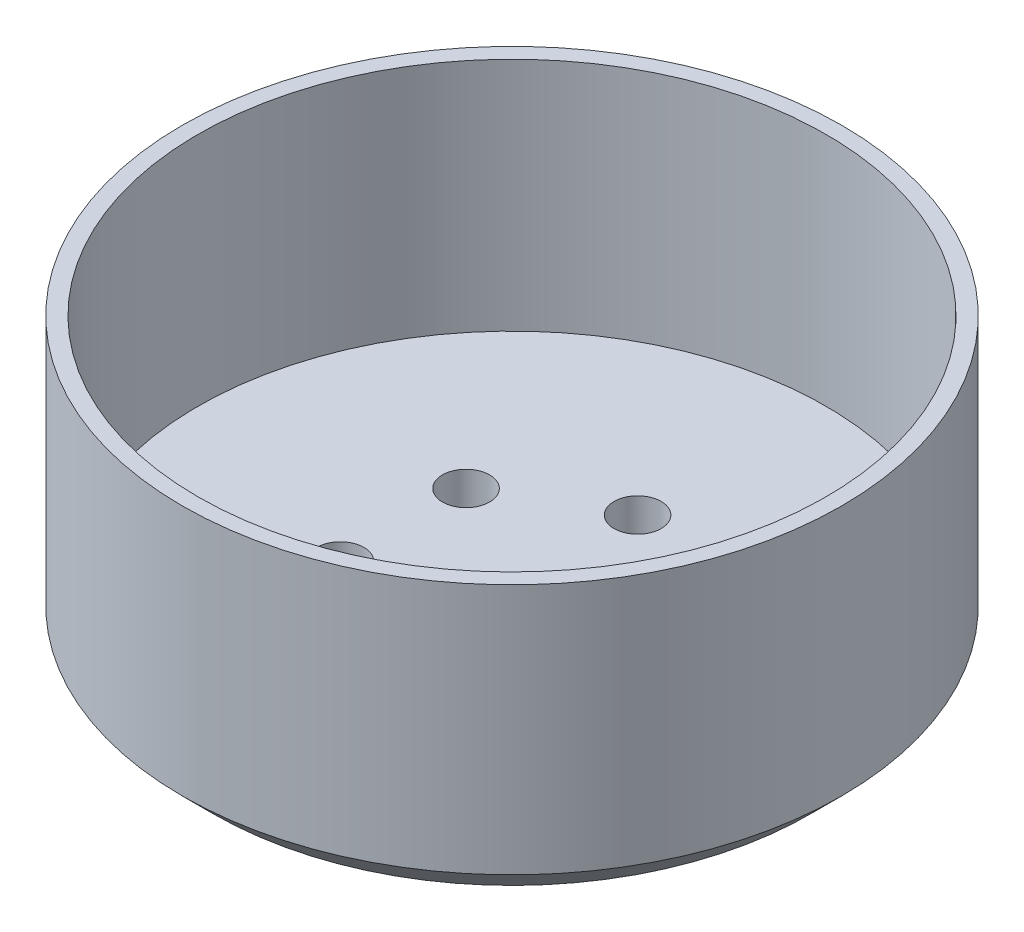
ISO-10303-21;
HEADER;
FILE_DESCRIPTION(('STEP AP214'),'2;1');
FILE_NAME('part.step','',(''),(''),'','','');
FILE_SCHEMA(('AUTOMOTIVE_DESIGN { 1 0 10303 214 1 1 1 1 }'));
ENDSEC;
DATA;
#1=APPLICATION_CONTEXT('core data for automotive mechanical design processes');
#2=APPLICATION_PROTOCOL_DEFINITION('international standard','automotive_design',2000,#1);
#3=PRODUCT_CONTEXT('',#1,'mechanical');
#4=PRODUCT('Part','Part','',(#3));
#5=PRODUCT_RELATED_PRODUCT_CATEGORY('part','',(#4));
#6=PRODUCT_DEFINITION_FORMATION('','',#4);
#7=PRODUCT_DEFINITION_CONTEXT('part definition',#1,'design');
#8=PRODUCT_DEFINITION('design','',#6,#7);
#9=PRODUCT_DEFINITION_SHAPE('','',#8);
#10=(LENGTH_UNIT() NAMED_UNIT(*) SI_UNIT(.MILLI.,.METRE.));
#11=(NAMED_UNIT(*) PLANE_ANGLE_UNIT() SI_UNIT($,.RADIAN.));
#12=(NAMED_UNIT(*) SI_UNIT($,.STERADIAN.) SOLID_ANGLE_UNIT());
#13=UNCERTAINTY_MEASURE_WITH_UNIT(LENGTH_MEASURE(1.E-05),#10,'distance_accuracy_value','');
#14=(GEOMETRIC_REPRESENTATION_CONTEXT(3) GLOBAL_UNCERTAINTY_ASSIGNED_CONTEXT((#13)) GLOBAL_UNIT_ASSIGNED_CONTEXT((#10,
#11,#12)) REPRESENTATION_CONTEXT('',''));
#15=CARTESIAN_POINT('',(0.,0.,0.));
#16=DIRECTION('',(0.,0.,1.));
#17=DIRECTION('',(1.,0.,0.));
#18=AXIS2_PLACEMENT_3D('',#15,#16,#17);
#19=CARTESIAN_POINT('',(0.,18.,0.));
#20=DIRECTION('',(0.,-1.,0.));
#21=DIRECTION('',(0.,0.,-1.));
#22=AXIS2_PLACEMENT_3D('',#19,#20,#21);
#23=CYLINDRICAL_SURFACE('',#22,21.);
#24=CARTESIAN_POINT('',(0.,18.,0.));
#25=DIRECTION('',(0.,1.,0.));
#26=DIRECTION('',(0.,0.,1.));
#27=AXIS2_PLACEMENT_3D('',#24,#25,#26);
#28=CIRCLE('',#27,21.);
#29=CARTESIAN_POINT('',(0.,18.,21.));
#30=VERTEX_POINT('',#29);
#31=EDGE_CURVE('E50',#30,#30,#28,.T.);
#32=ORIENTED_EDGE('',*,*,#31,.F.);
#33=EDGE_LOOP('',(#32));
#34=FACE_BOUND('',#33,.T.);
#35=CARTESIAN_POINT('',(0.,2.,0.));
#36=DIRECTION('',(0.,1.,0.));
#37=DIRECTION('',(0.,0.,1.));
#38=AXIS2_PLACEMENT_3D('',#35,#36,#37);
#39=CIRCLE('',#38,21.);
#40=CARTESIAN_POINT('',(0.,2.,21.));
#41=VERTEX_POINT('',#40);
#42=EDGE_CURVE('E59',#41,#41,#39,.T.);
#43=ORIENTED_EDGE('',*,*,#42,.T.);
#44=EDGE_LOOP('',(#43));
#45=FACE_BOUND('',#44,.T.);
#46=ADVANCED_FACE('F39',(#34,#45),#23,.T.);
#47=CARTESIAN_POINT('',(0.,3.,0.));
#48=DIRECTION('',(0.,1.,0.));
#49=DIRECTION('',(0.,0.,1.));
#50=AXIS2_PLACEMENT_3D('',#47,#48,#49);
#51=PLANE('',#50);
#52=CARTESIAN_POINT('',(0.,3.,8.));
#53=DIRECTION('',(0.,1.,0.));
#54=DIRECTION('',(0.,0.,1.));
#55=AXIS2_PLACEMENT_3D('',#52,#53,#54);
#56=CIRCLE('',#55,1.5);
#57=CARTESIAN_POINT('',(0.,3.,9.5));
#58=VERTEX_POINT('',#57);
#59=EDGE_CURVE('E65',#58,#58,#56,.T.);
#60=ORIENTED_EDGE('',*,*,#59,.F.);
#61=EDGE_LOOP('',(#60));
#62=FACE_BOUND('',#61,.T.);
#63=CARTESIAN_POINT('',(-6.92820323027534,3.,3.9999999999997));
#64=DIRECTION('',(0.,1.,0.));
#65=DIRECTION('',(0.,0.,1.));
#66=AXIS2_PLACEMENT_3D('',#63,#64,#65);
#67=CIRCLE('',#66,1.50000000000034);
#68=CARTESIAN_POINT('',(-6.92820323027534,3.,5.50000000000004));
#69=VERTEX_POINT('',#68);
#70=EDGE_CURVE('E68',#69,#69,#67,.T.);
#71=ORIENTED_EDGE('',*,*,#70,.F.);
#72=EDGE_LOOP('',(#71));
#73=FACE_BOUND('',#72,.T.);
#74=CARTESIAN_POINT('',(-6.928203230275,3.,-4.0000000000003));
#75=DIRECTION('',(0.,1.,0.));
#76=DIRECTION('',(0.,0.,1.));
#77=AXIS2_PLACEMENT_3D('',#74,#75,#76);
#78=CIRCLE('',#77,1.50000000000065);
#79=CARTESIAN_POINT('',(-6.928203230275,3.,-2.49999999999965));
#80=VERTEX_POINT('',#79);
#81=EDGE_CURVE('E71',#80,#80,#78,.T.);
#82=ORIENTED_EDGE('',*,*,#81,.F.);
#83=EDGE_LOOP('',(#82));
#84=FACE_BOUND('',#83,.T.);
#85=CARTESIAN_POINT('',(6.79181874011743E-13,3.,-8.));
#86=DIRECTION('',(0.,1.,0.));
#87=DIRECTION('',(0.,0.,1.));
#88=AXIS2_PLACEMENT_3D('',#85,#86,#87);
#89=CIRCLE('',#88,1.5000000000007);
#90=CARTESIAN_POINT('',(6.79181874011743E-13,3.,-6.4999999999993));
#91=VERTEX_POINT('',#90);
#92=EDGE_CURVE('E74',#91,#91,#89,.T.);
#93=ORIENTED_EDGE('',*,*,#92,.F.);
#94=EDGE_LOOP('',(#93));
#95=FACE_BOUND('',#94,.T.);
#96=CARTESIAN_POINT('',(6.92820323027602,3.,-3.9999999999997));
#97=DIRECTION('',(0.,1.,0.));
#98=DIRECTION('',(0.,0.,1.));
#99=AXIS2_PLACEMENT_3D('',#96,#97,#98);
#100=CIRCLE('',#99,1.50000000000044);
#101=CARTESIAN_POINT('',(6.92820323027602,3.,-2.49999999999927));
#102=VERTEX_POINT('',#101);
#103=EDGE_CURVE('E77',#102,#102,#100,.T.);
#104=ORIENTED_EDGE('',*,*,#103,.F.);
#105=EDGE_LOOP('',(#104));
#106=FACE_BOUND('',#105,.T.);
#107=CARTESIAN_POINT('',(6.92820323027568,3.,4.0000000000003));
#108=DIRECTION('',(0.,1.,0.));
#109=DIRECTION('',(0.,0.,1.));
#110=AXIS2_PLACEMENT_3D('',#107,#108,#109);
#111=CIRCLE('',#110,1.5000000000001);
#112=CARTESIAN_POINT('',(6.92820323027568,3.,5.50000000000039));
#113=VERTEX_POINT('',#112);
#114=EDGE_CURVE('E80',#113,#113,#111,.T.);
#115=ORIENTED_EDGE('',*,*,#114,.F.);
#116=EDGE_LOOP('',(#115));
#117=FACE_BOUND('',#116,.T.);
#118=CARTESIAN_POINT('',(0.,3.,0.));
#119=DIRECTION('',(0.,1.,0.));
#120=DIRECTION('',(0.,0.,1.));
#121=AXIS2_PLACEMENT_3D('',#118,#119,#120);
#122=CIRCLE('',#121,20.);
#123=CARTESIAN_POINT('',(0.,3.,20.));
#124=VERTEX_POINT('',#123);
#125=EDGE_CURVE('E46',#124,#124,#122,.F.);
#126=ORIENTED_EDGE('',*,*,#125,.F.);
#127=EDGE_LOOP('',(#126));
#128=FACE_BOUND('',#127,.T.);
#129=ADVANCED_FACE('F120',(#62,#73,#84,#95,#106,#117,#128),#51,.T.);
#130=CARTESIAN_POINT('',(0.,18.,0.));
#131=DIRECTION('',(0.,1.,0.));
#132=DIRECTION('',(0.,0.,1.));
#133=AXIS2_PLACEMENT_3D('',#130,#131,#132);
#134=PLANE('',#133);
#135=ORIENTED_EDGE('',*,*,#31,.T.);
#136=EDGE_LOOP('',(#135));
#137=FACE_BOUND('',#136,.T.);
#138=CARTESIAN_POINT('',(0.,18.,0.));
#139=DIRECTION('',(0.,1.,0.));
#140=DIRECTION('',(0.,0.,1.));
#141=AXIS2_PLACEMENT_3D('',#138,#139,#140);
#142=CIRCLE('',#141,20.);
#143=CARTESIAN_POINT('',(0.,18.,20.));
#144=VERTEX_POINT('',#143);
#145=EDGE_CURVE('E54',#144,#144,#142,.T.);
#146=ORIENTED_EDGE('',*,*,#145,.F.);
#147=EDGE_LOOP('',(#146));
#148=FACE_BOUND('',#147,.T.);
#149=ADVANCED_FACE('F126',(#137,#148),#134,.T.);
#150=CARTESIAN_POINT('',(0.,18.,0.));
#151=DIRECTION('',(0.,-1.,0.));
#152=DIRECTION('',(0.,0.,-1.));
#153=AXIS2_PLACEMENT_3D('',#150,#151,#152);
#154=CYLINDRICAL_SURFACE('',#153,20.);
#155=ORIENTED_EDGE('',*,*,#125,.T.);
#156=EDGE_LOOP('',(#155));
#157=FACE_BOUND('',#156,.T.);
#158=ORIENTED_EDGE('',*,*,#145,.T.);
#159=EDGE_LOOP('',(#158));
#160=FACE_BOUND('',#159,.T.);
#161=ADVANCED_FACE('F133',(#157,#160),#154,.F.);
#162=CARTESIAN_POINT('',(0.,2.,0.));
#163=DIRECTION('',(0.,1.,0.));
#164=DIRECTION('',(0.,0.,1.));
#165=AXIS2_PLACEMENT_3D('',#162,#163,#164);
#166=CONICAL_SURFACE('',#165,21.,0.785398163397449);
#167=CARTESIAN_POINT('',(0.,0.,0.));
#168=DIRECTION('',(0.,1.,0.));
#169=DIRECTION('',(0.,0.,1.));
#170=AXIS2_PLACEMENT_3D('',#167,#168,#169);
#171=CIRCLE('',#170,19.);
#172=CARTESIAN_POINT('',(0.,0.,19.));
#173=VERTEX_POINT('',#172);
#174=EDGE_CURVE('E62',#173,#173,#171,.T.);
#175=ORIENTED_EDGE('',*,*,#174,.T.);
#176=EDGE_LOOP('',(#175));
#177=FACE_BOUND('',#176,.T.);
#178=ORIENTED_EDGE('',*,*,#42,.F.);
#179=EDGE_LOOP('',(#178));
#180=FACE_BOUND('',#179,.T.);
#181=ADVANCED_FACE('F137',(#177,#180),#166,.T.);
#182=CARTESIAN_POINT('',(0.,0.,0.));
#183=DIRECTION('',(0.,1.,0.));
#184=DIRECTION('',(0.,0.,1.));
#185=AXIS2_PLACEMENT_3D('',#182,#183,#184);
#186=PLANE('',#185);
#187=CARTESIAN_POINT('',(0.,0.,0.));
#188=DIRECTION('',(0.,1.,0.));
#189=DIRECTION('',(0.,0.,1.));
#190=AXIS2_PLACEMENT_3D('',#187,#188,#189);
#191=CIRCLE('',#190,3.5);
#192=CARTESIAN_POINT('',(0.,0.,3.5));
#193=VERTEX_POINT('',#192);
#194=EDGE_CURVE('E10',#193,#193,#191,.F.);
#195=ORIENTED_EDGE('',*,*,#194,.F.);
#196=EDGE_LOOP('',(#195));
#197=FACE_BOUND('',#196,.T.);
#198=CARTESIAN_POINT('',(0.,0.,8.));
#199=DIRECTION('',(0.,-1.,0.));
#200=DIRECTION('',(0.,0.,-1.));
#201=AXIS2_PLACEMENT_3D('',#198,#199,#200);
#202=CIRCLE('',#201,1.5);
#203=CARTESIAN_POINT('',(0.,0.,6.5));
#204=VERTEX_POINT('',#203);
#205=EDGE_CURVE('E83',#204,#204,#202,.T.);
#206=ORIENTED_EDGE('',*,*,#205,.F.);
#207=EDGE_LOOP('',(#206));
#208=FACE_BOUND('',#207,.T.);
#209=CARTESIAN_POINT('',(-6.92820323027534,0.,3.9999999999997));
#210=DIRECTION('',(0.,-1.,0.));
#211=DIRECTION('',(0.,0.,-1.));
#212=AXIS2_PLACEMENT_3D('',#209,#210,#211);
#213=CIRCLE('',#212,1.50000000000034);
#214=CARTESIAN_POINT('',(-6.92820323027534,0.,2.49999999999936));
#215=VERTEX_POINT('',#214);
#216=EDGE_CURVE('E88',#215,#215,#213,.T.);
#217=ORIENTED_EDGE('',*,*,#216,.F.);
#218=EDGE_LOOP('',(#217));
#219=FACE_BOUND('',#218,.T.);
#220=CARTESIAN_POINT('',(-6.928203230275,0.,-4.0000000000003));
#221=DIRECTION('',(0.,-1.,0.));
#222=DIRECTION('',(0.,0.,-1.));
#223=AXIS2_PLACEMENT_3D('',#220,#221,#222);
#224=CIRCLE('',#223,1.50000000000065);
#225=CARTESIAN_POINT('',(-6.928203230275,0.,-5.50000000000094));
#226=VERTEX_POINT('',#225);
#227=EDGE_CURVE('E84',#226,#226,#224,.T.);
#228=ORIENTED_EDGE('',*,*,#227,.F.);
#229=EDGE_LOOP('',(#228));
#230=FACE_BOUND('',#229,.T.);
#231=CARTESIAN_POINT('',(6.79181874011743E-13,0.,-8.));
#232=DIRECTION('',(0.,-1.,0.));
#233=DIRECTION('',(0.,0.,-1.));
#234=AXIS2_PLACEMENT_3D('',#231,#232,#233);
#235=CIRCLE('',#234,1.5000000000007);
#236=CARTESIAN_POINT('',(6.79181874011743E-13,0.,-9.5000000000007));
#237=VERTEX_POINT('',#236);
#238=EDGE_CURVE('E87',#237,#237,#235,.T.);
#239=ORIENTED_EDGE('',*,*,#238,.F.);
#240=EDGE_LOOP('',(#239));
#241=FACE_BOUND('',#240,.T.);
#242=CARTESIAN_POINT('',(6.92820323027602,0.,-3.9999999999997));
#243=DIRECTION('',(0.,-1.,0.));
#244=DIRECTION('',(0.,0.,-1.));
#245=AXIS2_PLACEMENT_3D('',#242,#243,#244);
#246=CIRCLE('',#245,1.50000000000044);
#247=CARTESIAN_POINT('',(6.92820323027602,0.,-5.50000000000014));
#248=VERTEX_POINT('',#247);
#249=EDGE_CURVE('E91',#248,#248,#246,.T.);
#250=ORIENTED_EDGE('',*,*,#249,.F.);
#251=EDGE_LOOP('',(#250));
#252=FACE_BOUND('',#251,.T.);
#253=CARTESIAN_POINT('',(6.92820323027568,0.,4.0000000000003));
#254=DIRECTION('',(0.,-1.,0.));
#255=DIRECTION('',(0.,0.,-1.));
#256=AXIS2_PLACEMENT_3D('',#253,#254,#255);
#257=CIRCLE('',#256,1.5000000000001);
#258=CARTESIAN_POINT('',(6.92820323027568,0.,2.5000000000002));
#259=VERTEX_POINT('',#258);
#260=EDGE_CURVE('E94',#259,#259,#257,.T.);
#261=ORIENTED_EDGE('',*,*,#260,.F.);
#262=EDGE_LOOP('',(#261));
#263=FACE_BOUND('',#262,.T.);
#264=ORIENTED_EDGE('',*,*,#174,.F.);
#265=EDGE_LOOP('',(#264));
#266=FACE_BOUND('',#265,.T.);
#267=ADVANCED_FACE('F41',(#197,#208,#219,#230,#241,#252,#263,#266),#186,.F.);
#268=CARTESIAN_POINT('',(6.92820323027568,17.,4.0000000000003));
#269=DIRECTION('',(0.,-1.,0.));
#270=DIRECTION('',(0.,0.,-1.));
#271=AXIS2_PLACEMENT_3D('',#268,#269,#270);
#272=CYLINDRICAL_SURFACE('',#271,1.5000000000001);
#273=ORIENTED_EDGE('',*,*,#114,.T.);
#274=EDGE_LOOP('',(#273));
#275=FACE_BOUND('',#274,.T.);
#276=ORIENTED_EDGE('',*,*,#260,.T.);
#277=EDGE_LOOP('',(#276));
#278=FACE_BOUND('',#277,.T.);
#279=ADVANCED_FACE('F152',(#275,#278),#272,.F.);
#280=CARTESIAN_POINT('',(6.92820323027602,17.,-3.9999999999997));
#281=DIRECTION('',(0.,-1.,0.));
#282=DIRECTION('',(0.,0.,-1.));
#283=AXIS2_PLACEMENT_3D('',#280,#281,#282);
#284=CYLINDRICAL_SURFACE('',#283,1.50000000000044);
#285=ORIENTED_EDGE('',*,*,#103,.T.);
#286=EDGE_LOOP('',(#285));
#287=FACE_BOUND('',#286,.T.);
#288=ORIENTED_EDGE('',*,*,#249,.T.);
#289=EDGE_LOOP('',(#288));
#290=FACE_BOUND('',#289,.T.);
#291=ADVANCED_FACE('F148',(#287,#290),#284,.F.);
#292=CARTESIAN_POINT('',(6.79181874011743E-13,17.,-8.));
#293=DIRECTION('',(0.,-1.,0.));
#294=DIRECTION('',(0.,0.,-1.));
#295=AXIS2_PLACEMENT_3D('',#292,#293,#294);
#296=CYLINDRICAL_SURFACE('',#295,1.5000000000007);
#297=ORIENTED_EDGE('',*,*,#92,.T.);
#298=EDGE_LOOP('',(#297));
#299=FACE_BOUND('',#298,.T.);
#300=ORIENTED_EDGE('',*,*,#238,.T.);
#301=EDGE_LOOP('',(#300));
#302=FACE_BOUND('',#301,.T.);
#303=ADVANCED_FACE('F144',(#299,#302),#296,.F.);
#304=CARTESIAN_POINT('',(-6.928203230275,17.,-4.0000000000003));
#305=DIRECTION('',(0.,-1.,0.));
#306=DIRECTION('',(0.,0.,-1.));
#307=AXIS2_PLACEMENT_3D('',#304,#305,#306);
#308=CYLINDRICAL_SURFACE('',#307,1.50000000000065);
#309=ORIENTED_EDGE('',*,*,#81,.T.);
#310=EDGE_LOOP('',(#309));
#311=FACE_BOUND('',#310,.T.);
#312=ORIENTED_EDGE('',*,*,#227,.T.);
#313=EDGE_LOOP('',(#312));
#314=FACE_BOUND('',#313,.T.);
#315=ADVANCED_FACE('F141',(#311,#314),#308,.F.);
#316=CARTESIAN_POINT('',(-6.92820323027534,17.,3.9999999999997));
#317=DIRECTION('',(0.,-1.,0.));
#318=DIRECTION('',(0.,0.,-1.));
#319=AXIS2_PLACEMENT_3D('',#316,#317,#318);
#320=CYLINDRICAL_SURFACE('',#319,1.50000000000034);
#321=ORIENTED_EDGE('',*,*,#70,.T.);
#322=EDGE_LOOP('',(#321));
#323=FACE_BOUND('',#322,.T.);
#324=ORIENTED_EDGE('',*,*,#216,.T.);
#325=EDGE_LOOP('',(#324));
#326=FACE_BOUND('',#325,.T.);
#327=ADVANCED_FACE('F116',(#323,#326),#320,.F.);
#328=CARTESIAN_POINT('',(0.,17.,8.));
#329=DIRECTION('',(0.,-1.,0.));
#330=DIRECTION('',(0.,0.,-1.));
#331=AXIS2_PLACEMENT_3D('',#328,#329,#330);
#332=CYLINDRICAL_SURFACE('',#331,1.5);
#333=ORIENTED_EDGE('',*,*,#59,.T.);
#334=EDGE_LOOP('',(#333));
#335=FACE_BOUND('',#334,.T.);
#336=ORIENTED_EDGE('',*,*,#205,.T.);
#337=EDGE_LOOP('',(#336));
#338=FACE_BOUND('',#337,.T.);
#339=ADVANCED_FACE('F109',(#335,#338),#332,.F.);
#340=CARTESIAN_POINT('',(0.,-1.,0.));
#341=DIRECTION('',(0.,1.,0.));
#342=DIRECTION('',(0.,0.,1.));
#343=AXIS2_PLACEMENT_3D('',#340,#341,#342);
#344=CYLINDRICAL_SURFACE('',#343,3.5);
#345=CARTESIAN_POINT('',(0.,-1.,0.));
#346=DIRECTION('',(0.,-1.,0.));
#347=DIRECTION('',(0.,0.,-1.));
#348=AXIS2_PLACEMENT_3D('',#345,#346,#347);
#349=CIRCLE('',#348,3.5);
#350=CARTESIAN_POINT('',(0.,-1.,-3.5));
#351=VERTEX_POINT('',#350);
#352=EDGE_CURVE('E99',#351,#351,#349,.T.);
#353=ORIENTED_EDGE('',*,*,#352,.F.);
#354=EDGE_LOOP('',(#353));
#355=FACE_BOUND('',#354,.T.);
#356=ORIENTED_EDGE('',*,*,#194,.T.);
#357=EDGE_LOOP('',(#356));
#358=FACE_BOUND('',#357,.T.);
#359=ADVANCED_FACE('F107',(#355,#358),#344,.T.);
#360=CARTESIAN_POINT('',(0.,-1.,0.));
#361=DIRECTION('',(0.,-1.,0.));
#362=DIRECTION('',(0.,0.,-1.));
#363=AXIS2_PLACEMENT_3D('',#360,#361,#362);
#364=PLANE('',#363);
#365=ORIENTED_EDGE('',*,*,#352,.T.);
#366=EDGE_LOOP('',(#365));
#367=FACE_BOUND('',#366,.T.);
#368=ADVANCED_FACE('F105',(#367),#364,.T.);
#369=CLOSED_SHELL('',(#46,#129,#149,#161,#181,#267,#279,#291,#303,#315,#327,#339,#359,#368));
#370=MANIFOLD_SOLID_BREP('B2',#369);
#371=ADVANCED_BREP_SHAPE_REPRESENTATION('',(#18,#370),#14);
#372=SHAPE_DEFINITION_REPRESENTATION(#9,#371);
ENDSEC;
END-ISO-10303-21;
